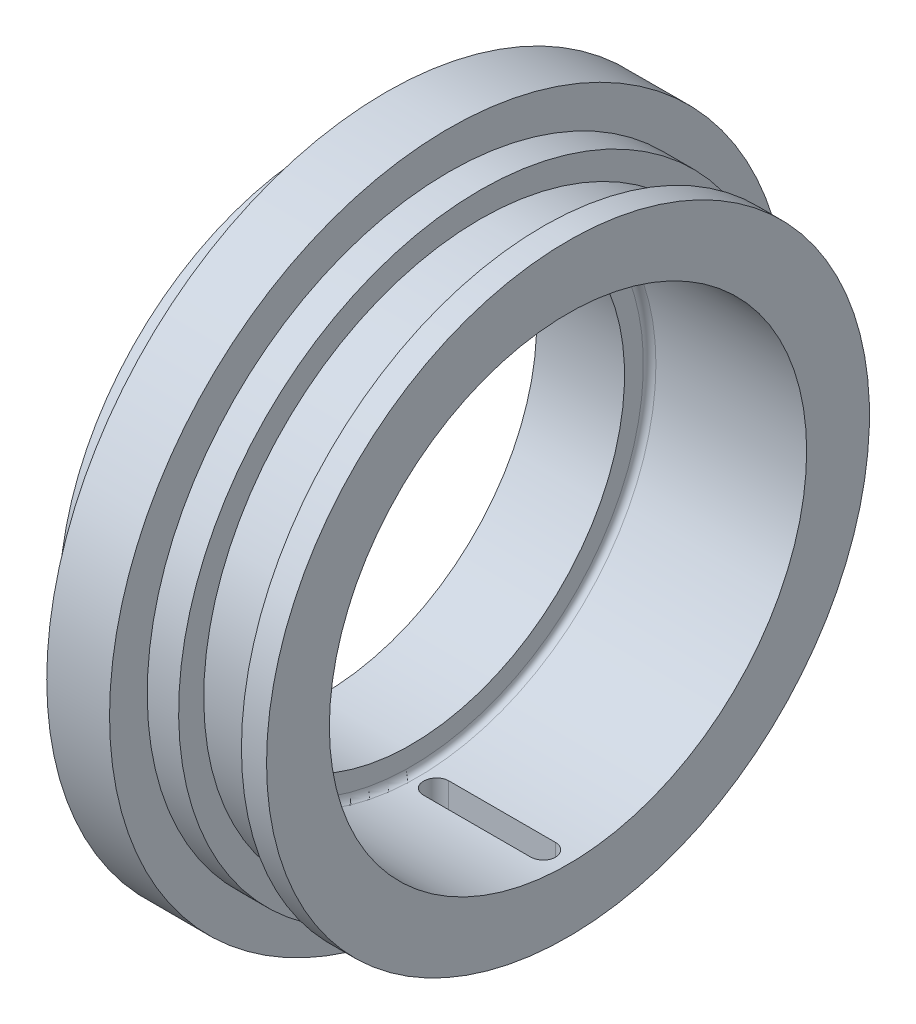
ISO-10303-21;
HEADER;
FILE_DESCRIPTION(('STEP AP214'),'2;1');
FILE_NAME('part.step','',(''),(''),'','','');
FILE_SCHEMA(('AUTOMOTIVE_DESIGN { 1 0 10303 214 1 1 1 1 }'));
ENDSEC;
DATA;
#1=APPLICATION_CONTEXT('core data for automotive mechanical design processes');
#2=APPLICATION_PROTOCOL_DEFINITION('international standard','automotive_design',2000,#1);
#3=PRODUCT_CONTEXT('',#1,'mechanical');
#4=PRODUCT('Part','Part','',(#3));
#5=PRODUCT_RELATED_PRODUCT_CATEGORY('part','',(#4));
#6=PRODUCT_DEFINITION_FORMATION('','',#4);
#7=PRODUCT_DEFINITION_CONTEXT('part definition',#1,'design');
#8=PRODUCT_DEFINITION('design','',#6,#7);
#9=PRODUCT_DEFINITION_SHAPE('','',#8);
#10=(LENGTH_UNIT() NAMED_UNIT(*) SI_UNIT(.MILLI.,.METRE.));
#11=(NAMED_UNIT(*) PLANE_ANGLE_UNIT() SI_UNIT($,.RADIAN.));
#12=(NAMED_UNIT(*) SI_UNIT($,.STERADIAN.) SOLID_ANGLE_UNIT());
#13=UNCERTAINTY_MEASURE_WITH_UNIT(LENGTH_MEASURE(1.E-05),#10,'distance_accuracy_value','');
#14=(GEOMETRIC_REPRESENTATION_CONTEXT(3) GLOBAL_UNCERTAINTY_ASSIGNED_CONTEXT((#13)) GLOBAL_UNIT_ASSIGNED_CONTEXT((#10,
#11,#12)) REPRESENTATION_CONTEXT('',''));
#15=CARTESIAN_POINT('',(0.,0.,0.));
#16=DIRECTION('',(0.,0.,1.));
#17=DIRECTION('',(1.,0.,0.));
#18=AXIS2_PLACEMENT_3D('',#15,#16,#17);
#19=CARTESIAN_POINT('',(-351.05,19.,0.));
#20=DIRECTION('',(-1.,0.,0.));
#21=DIRECTION('',(0.,0.,1.));
#22=AXIS2_PLACEMENT_3D('',#19,#20,#21);
#23=PLANE('',#22);
#24=CARTESIAN_POINT('',(-351.05,0.,0.));
#25=DIRECTION('',(-1.,0.,0.));
#26=DIRECTION('',(0.,0.,1.));
#27=AXIS2_PLACEMENT_3D('',#24,#25,#26);
#28=CIRCLE('',#27,23.9999999999999);
#29=CARTESIAN_POINT('',(-351.05,0.,23.9999999999999));
#30=VERTEX_POINT('',#29);
#31=EDGE_CURVE('E226',#30,#30,#28,.T.);
#32=ORIENTED_EDGE('',*,*,#31,.F.);
#33=EDGE_LOOP('',(#32));
#34=FACE_BOUND('',#33,.T.);
#35=CARTESIAN_POINT('',(-351.05,0.,0.));
#36=DIRECTION('',(-1.,0.,0.));
#37=DIRECTION('',(0.,0.,1.));
#38=AXIS2_PLACEMENT_3D('',#35,#36,#37);
#39=CIRCLE('',#38,19.);
#40=CARTESIAN_POINT('',(-351.05,0.,19.));
#41=VERTEX_POINT('',#40);
#42=EDGE_CURVE('E182',#41,#41,#39,.T.);
#43=ORIENTED_EDGE('',*,*,#42,.T.);
#44=EDGE_LOOP('',(#43));
#45=FACE_BOUND('',#44,.T.);
#46=ADVANCED_FACE('F40',(#34,#45),#23,.F.);
#47=CARTESIAN_POINT('',(-379.936676628727,0.,0.));
#48=DIRECTION('',(-1.,0.,0.));
#49=DIRECTION('',(0.,0.,1.));
#50=AXIS2_PLACEMENT_3D('',#47,#48,#49);
#51=CYLINDRICAL_SURFACE('',#50,23.9999999999999);
#52=CARTESIAN_POINT('',(-353.05,0.,0.));
#53=DIRECTION('',(-1.,0.,0.));
#54=DIRECTION('',(0.,0.,1.));
#55=AXIS2_PLACEMENT_3D('',#52,#53,#54);
#56=CIRCLE('',#55,23.9999999999999);
#57=CARTESIAN_POINT('',(-353.05,-23.9791576165635,1.));
#58=VERTEX_POINT('',#57);
#59=CARTESIAN_POINT('',(-353.05,-23.9791576165635,-1.));
#60=VERTEX_POINT('',#59);
#61=EDGE_CURVE('E223',#58,#60,#56,.T.);
#62=ORIENTED_EDGE('',*,*,#61,.F.);
#63=CARTESIAN_POINT('',(-353.05,-23.9791576165635,-1.));
#64=CARTESIAN_POINT('',(-353.021878957385,-23.9791573385159,-0.999999827751996));
#65=CARTESIAN_POINT('',(-352.993771399304,-23.9792071471564,-0.99881306616118));
#66=CARTESIAN_POINT('',(-352.937757642638,-23.9794039927136,-0.994078686094258));
#67=CARTESIAN_POINT('',(-352.909851433839,-23.9795510246631,-0.990531188228068));
#68=CARTESIAN_POINT('',(-352.826782544367,-23.9801329123692,-0.976381299636252));
#69=CARTESIAN_POINT('',(-352.772176693938,-23.980708578784,-0.96227142081713));
#70=CARTESIAN_POINT('',(-352.666113877668,-23.9821714364867,-0.925091988008807));
#71=CARTESIAN_POINT('',(-352.614658336882,-23.9830587675522,-0.902018413424585));
#72=CARTESIAN_POINT('',(-352.516352897202,-23.9850445854284,-0.847570330342763));
#73=CARTESIAN_POINT('',(-352.46950215651,-23.9861430335361,-0.816197342938941));
#74=CARTESIAN_POINT('',(-352.381705963261,-23.9884281594866,-0.746018660575475));
#75=CARTESIAN_POINT('',(-352.340763848984,-23.9896148866363,-0.707208792493843));
#76=CARTESIAN_POINT('',(-352.26596747742,-23.9919425217121,-0.623260548927584));
#77=CARTESIAN_POINT('',(-352.232114300049,-23.9930834226357,-0.578121210967041));
#78=CARTESIAN_POINT('',(-352.172455072029,-23.9951910307319,-0.482781699887445));
#79=CARTESIAN_POINT('',(-352.146651602661,-23.9961576819864,-0.432579910217997));
#80=CARTESIAN_POINT('',(-352.103842156875,-23.9978072858589,-0.328555206896849));
#81=CARTESIAN_POINT('',(-352.086835586406,-23.9984902576331,-0.274732538039683));
#82=CARTESIAN_POINT('',(-352.062109654267,-23.9994952696334,-0.16502344784435));
#83=CARTESIAN_POINT('',(-352.054385025953,-23.9998175145316,-0.109138215393339));
#84=CARTESIAN_POINT('',(-352.048425961082,-24.0000654431746,0.00313799608098518));
#85=CARTESIAN_POINT('',(-352.050191702193,-23.9999911194953,0.0595289845527943));
#86=CARTESIAN_POINT('',(-352.063159191693,-23.9994544467782,0.17117717141178));
#87=CARTESIAN_POINT('',(-352.074354985778,-23.9989923425928,0.226435062709367));
#88=CARTESIAN_POINT('',(-352.105855518668,-23.9977324592887,0.334286162822794));
#89=CARTESIAN_POINT('',(-352.12616024729,-23.9969346805453,0.386879374617531));
#90=CARTESIAN_POINT('',(-352.175309544836,-23.995092896028,0.487928656756748));
#91=CARTESIAN_POINT('',(-352.204157014358,-23.9940488066466,0.536383314688192));
#92=CARTESIAN_POINT('',(-352.269569406668,-23.9918320934257,0.627761971064696));
#93=CARTESIAN_POINT('',(-352.30613399507,-23.9906594751566,0.670686209015598));
#94=CARTESIAN_POINT('',(-352.385970360387,-23.9883168597931,0.749817172069834));
#95=CARTESIAN_POINT('',(-352.429246325357,-23.9871468648014,0.786019671443447));
#96=CARTESIAN_POINT('',(-352.521281255319,-23.984941758122,0.850657803488658));
#97=CARTESIAN_POINT('',(-352.570041944584,-23.983906689074,0.879090983975148));
#98=CARTESIAN_POINT('',(-352.671670888822,-23.982088107858,0.927381585411384));
#99=CARTESIAN_POINT('',(-352.724541696933,-23.9813047536272,0.947233624856723));
#100=CARTESIAN_POINT('',(-352.832828915137,-23.9800801998383,0.97774777026732));
#101=CARTESIAN_POINT('',(-352.888241307446,-23.9796384787119,0.988423887820018));
#102=CARTESIAN_POINT('',(-352.961687747243,-23.9793136836998,0.996251123804624));
#103=CARTESIAN_POINT('',(-352.979336403255,-23.9792551894172,0.99765768814785));
#104=CARTESIAN_POINT('',(-353.014654311973,-23.9791772074594,0.999530844671079));
#105=CARTESIAN_POINT('',(-353.032323482083,-23.9791576553063,0.999998990632797));
#106=CARTESIAN_POINT('',(-353.05,-23.9791576165635,1.));
#107=B_SPLINE_CURVE_WITH_KNOTS('',3,(#63,#64,#65,#66,#67,#68,#69,#70,#71,#72,#73,#74,#75,#76,
#77,#78,#79,#80,#81,#82,#83,#84,#85,#86,#87,#88,#89,#90,#91,#92,#93,#94,#95,#96,#97,#98,#99,
#100,#101,#102,#103,#104,#105,#106),.UNSPECIFIED.,.F.,.F.,(4,2,2,2,2,2,2,2,2,2,2,2,2,2,2,2,2,2,
2,2,2,4),(0.,0.0843112718973622,0.168618236666047,0.336956996072197,0.505371349843703,
0.673754858450239,0.84223313173336,1.01073705210699,1.17929495084417,1.34784146542164,
1.5162923002099,1.68474628856682,1.85309399172124,2.0214415066722,2.18984624788381,
2.3582436935399,2.5267466491502,2.6953027271015,2.86396435906508,3.0323679856424,
3.08546462609338,3.13847327917958),.UNSPECIFIED.);
#108=EDGE_CURVE('E175',#60,#58,#107,.T.);
#109=ORIENTED_EDGE('',*,*,#108,.F.);
#110=EDGE_LOOP('',(#62,#109));
#111=FACE_BOUND('',#110,.T.);
#112=ORIENTED_EDGE('',*,*,#31,.T.);
#113=EDGE_LOOP('',(#112));
#114=FACE_BOUND('',#113,.T.);
#115=ADVANCED_FACE('F240',(#111,#114),#51,.T.);
#116=CARTESIAN_POINT('',(-353.05,23.9999999999999,0.));
#117=DIRECTION('',(1.,0.,0.));
#118=DIRECTION('',(0.,0.,-1.));
#119=AXIS2_PLACEMENT_3D('',#116,#117,#118);
#120=PLANE('',#119);
#121=ORIENTED_EDGE('',*,*,#61,.T.);
#122=DIRECTION('',(0.,1.,0.));
#123=VECTOR('',#122,1.);
#124=CARTESIAN_POINT('',(-353.05,-27.0009999999999,-1.));
#125=LINE('',#124,#123);
#126=CARTESIAN_POINT('',(-353.05,-21.9772609758359,-1.));
#127=VERTEX_POINT('',#126);
#128=EDGE_CURVE('E118',#60,#127,#125,.T.);
#129=ORIENTED_EDGE('',*,*,#128,.T.);
#130=CARTESIAN_POINT('',(-353.05,0.,0.));
#131=DIRECTION('',(-1.,0.,0.));
#132=DIRECTION('',(0.,0.,1.));
#133=AXIS2_PLACEMENT_3D('',#130,#131,#132);
#134=CIRCLE('',#133,21.9999999999999);
#135=CARTESIAN_POINT('',(-353.05,-21.9772609758359,1.));
#136=VERTEX_POINT('',#135);
#137=EDGE_CURVE('E220',#136,#127,#134,.T.);
#138=ORIENTED_EDGE('',*,*,#137,.F.);
#139=DIRECTION('',(0.,1.,0.));
#140=VECTOR('',#139,1.);
#141=CARTESIAN_POINT('',(-353.05,-27.0009999999999,1.));
#142=LINE('',#141,#140);
#143=EDGE_CURVE('E342',#58,#136,#142,.T.);
#144=ORIENTED_EDGE('',*,*,#143,.F.);
#145=EDGE_LOOP('',(#121,#129,#138,#144));
#146=FACE_BOUND('',#145,.T.);
#147=ADVANCED_FACE('F245',(#146),#120,.F.);
#148=CARTESIAN_POINT('',(-379.936676628727,0.,0.));
#149=DIRECTION('',(-1.,0.,0.));
#150=DIRECTION('',(0.,0.,1.));
#151=AXIS2_PLACEMENT_3D('',#148,#149,#150);
#152=CYLINDRICAL_SURFACE('',#151,21.9999999999999);
#153=CARTESIAN_POINT('',(-358.05,0.,0.));
#154=DIRECTION('',(-1.,0.,0.));
#155=DIRECTION('',(0.,0.,1.));
#156=AXIS2_PLACEMENT_3D('',#153,#154,#155);
#157=CIRCLE('',#156,21.9999999999999);
#158=CARTESIAN_POINT('',(-358.05,-21.9772609758359,1.));
#159=VERTEX_POINT('',#158);
#160=CARTESIAN_POINT('',(-358.05,-21.9772609758359,-0.999999999999999));
#161=VERTEX_POINT('',#160);
#162=EDGE_CURVE('E217',#159,#161,#157,.T.);
#163=ORIENTED_EDGE('',*,*,#162,.F.);
#164=DIRECTION('',(-1.,0.,0.));
#165=VECTOR('',#164,1.);
#166=CARTESIAN_POINT('',(-379.936676628727,-21.9772609758359,1.));
#167=LINE('',#166,#165);
#168=EDGE_CURVE('E339',#136,#159,#167,.T.);
#169=ORIENTED_EDGE('',*,*,#168,.F.);
#170=ORIENTED_EDGE('',*,*,#137,.T.);
#171=DIRECTION('',(-1.,0.,0.));
#172=VECTOR('',#171,1.);
#173=CARTESIAN_POINT('',(-379.936676628727,-21.9772609758359,-0.999999999999996));
#174=LINE('',#173,#172);
#175=EDGE_CURVE('E183',#161,#127,#174,.F.);
#176=ORIENTED_EDGE('',*,*,#175,.F.);
#177=EDGE_LOOP('',(#163,#169,#170,#176));
#178=FACE_BOUND('',#177,.T.);
#179=ADVANCED_FACE('F253',(#178),#152,.T.);
#180=CARTESIAN_POINT('',(-358.05,21.9999999999999,0.));
#181=DIRECTION('',(-1.,0.,0.));
#182=DIRECTION('',(0.,0.,1.));
#183=AXIS2_PLACEMENT_3D('',#180,#181,#182);
#184=PLANE('',#183);
#185=CARTESIAN_POINT('',(-358.05,0.,0.));
#186=DIRECTION('',(-1.,0.,0.));
#187=DIRECTION('',(0.,0.,1.));
#188=AXIS2_PLACEMENT_3D('',#185,#186,#187);
#189=CIRCLE('',#188,23.9999999999999);
#190=CARTESIAN_POINT('',(-358.05,-23.9791576165635,1.));
#191=VERTEX_POINT('',#190);
#192=CARTESIAN_POINT('',(-358.05,-23.9791576165635,-0.999999999999996));
#193=VERTEX_POINT('',#192);
#194=EDGE_CURVE('E214',#191,#193,#189,.T.);
#195=ORIENTED_EDGE('',*,*,#194,.F.);
#196=DIRECTION('',(0.,-1.,0.));
#197=VECTOR('',#196,1.);
#198=CARTESIAN_POINT('',(-358.05,-27.0009999999999,1.));
#199=LINE('',#198,#197);
#200=EDGE_CURVE('E343',#159,#191,#199,.T.);
#201=ORIENTED_EDGE('',*,*,#200,.F.);
#202=ORIENTED_EDGE('',*,*,#162,.T.);
#203=DIRECTION('',(0.,1.,0.));
#204=VECTOR('',#203,1.);
#205=CARTESIAN_POINT('',(-358.05,-27.0009999999999,-0.999999999999999));
#206=LINE('',#205,#204);
#207=EDGE_CURVE('E329',#193,#161,#206,.T.);
#208=ORIENTED_EDGE('',*,*,#207,.F.);
#209=EDGE_LOOP('',(#195,#201,#202,#208));
#210=FACE_BOUND('',#209,.T.);
#211=ADVANCED_FACE('F257',(#210),#184,.F.);
#212=CARTESIAN_POINT('',(-379.936676628727,0.,0.));
#213=DIRECTION('',(-1.,0.,0.));
#214=DIRECTION('',(0.,0.,1.));
#215=AXIS2_PLACEMENT_3D('',#212,#213,#214);
#216=CYLINDRICAL_SURFACE('',#215,23.9999999999999);
#217=CARTESIAN_POINT('',(-360.55,0.,0.));
#218=DIRECTION('',(-1.,0.,0.));
#219=DIRECTION('',(0.,0.,1.));
#220=AXIS2_PLACEMENT_3D('',#217,#218,#219);
#221=CIRCLE('',#220,23.9999999999999);
#222=CARTESIAN_POINT('',(-360.55,-23.9791576165635,1.));
#223=VERTEX_POINT('',#222);
#224=CARTESIAN_POINT('',(-360.55,-23.9791576165635,-0.999999999999999));
#225=VERTEX_POINT('',#224);
#226=EDGE_CURVE('E211',#223,#225,#221,.T.);
#227=ORIENTED_EDGE('',*,*,#226,.F.);
#228=DIRECTION('',(-1.,0.,0.));
#229=VECTOR('',#228,1.);
#230=CARTESIAN_POINT('',(-379.936676628727,-23.9791576165635,1.));
#231=LINE('',#230,#229);
#232=EDGE_CURVE('E347',#191,#223,#231,.T.);
#233=ORIENTED_EDGE('',*,*,#232,.F.);
#234=ORIENTED_EDGE('',*,*,#194,.T.);
#235=DIRECTION('',(-1.,0.,0.));
#236=VECTOR('',#235,1.);
#237=CARTESIAN_POINT('',(-379.936676628727,-23.9791576165635,-0.999999999999996));
#238=LINE('',#237,#236);
#239=EDGE_CURVE('E324',#225,#193,#238,.F.);
#240=ORIENTED_EDGE('',*,*,#239,.F.);
#241=EDGE_LOOP('',(#227,#233,#234,#240));
#242=FACE_BOUND('',#241,.T.);
#243=ADVANCED_FACE('F261',(#242),#216,.T.);
#244=CARTESIAN_POINT('',(-360.55,23.9999999999999,0.));
#245=DIRECTION('',(-1.,0.,0.));
#246=DIRECTION('',(0.,0.,1.));
#247=AXIS2_PLACEMENT_3D('',#244,#245,#246);
#248=PLANE('',#247);
#249=CARTESIAN_POINT('',(-360.55,0.,0.));
#250=DIRECTION('',(-1.,0.,0.));
#251=DIRECTION('',(0.,0.,1.));
#252=AXIS2_PLACEMENT_3D('',#249,#250,#251);
#253=CIRCLE('',#252,26.9999999999999);
#254=CARTESIAN_POINT('',(-360.55,-26.981475126464,1.));
#255=VERTEX_POINT('',#254);
#256=CARTESIAN_POINT('',(-360.55,-26.981475126464,-0.999999999999996));
#257=VERTEX_POINT('',#256);
#258=EDGE_CURVE('E208',#255,#257,#253,.T.);
#259=ORIENTED_EDGE('',*,*,#258,.F.);
#260=DIRECTION('',(0.,-1.,0.));
#261=VECTOR('',#260,1.);
#262=CARTESIAN_POINT('',(-360.55,-27.0009999999999,1.));
#263=LINE('',#262,#261);
#264=EDGE_CURVE('E352',#223,#255,#263,.T.);
#265=ORIENTED_EDGE('',*,*,#264,.F.);
#266=ORIENTED_EDGE('',*,*,#226,.T.);
#267=DIRECTION('',(0.,1.,0.));
#268=VECTOR('',#267,1.);
#269=CARTESIAN_POINT('',(-360.55,-27.0009999999999,-0.999999999999999));
#270=LINE('',#269,#268);
#271=EDGE_CURVE('E321',#257,#225,#270,.T.);
#272=ORIENTED_EDGE('',*,*,#271,.F.);
#273=EDGE_LOOP('',(#259,#265,#266,#272));
#274=FACE_BOUND('',#273,.T.);
#275=ADVANCED_FACE('F265',(#274),#248,.F.);
#276=CARTESIAN_POINT('',(-379.936676628727,0.,0.));
#277=DIRECTION('',(-1.,0.,0.));
#278=DIRECTION('',(0.,0.,1.));
#279=AXIS2_PLACEMENT_3D('',#276,#277,#278);
#280=CYLINDRICAL_SURFACE('',#279,26.9999999999999);
#281=CARTESIAN_POINT('',(-365.55,0.,0.));
#282=DIRECTION('',(-1.,0.,0.));
#283=DIRECTION('',(0.,0.,1.));
#284=AXIS2_PLACEMENT_3D('',#281,#282,#283);
#285=CIRCLE('',#284,26.9999999999999);
#286=CARTESIAN_POINT('',(-365.55,0.,26.9999999999999));
#287=VERTEX_POINT('',#286);
#288=EDGE_CURVE('E205',#287,#287,#285,.T.);
#289=ORIENTED_EDGE('',*,*,#288,.F.);
#290=EDGE_LOOP('',(#289));
#291=FACE_BOUND('',#290,.T.);
#292=CARTESIAN_POINT('',(-361.55,-26.981475126464,1.));
#293=CARTESIAN_POINT('',(-361.578123764318,-26.9814748794738,0.999999824698651));
#294=CARTESIAN_POINT('',(-361.606234045268,-26.9815191541466,0.998812836472681));
#295=CARTESIAN_POINT('',(-361.662253278417,-26.9816941302732,0.994077532231824));
#296=CARTESIAN_POINT('',(-361.690162240694,-26.9818248273699,0.990529335260153));
#297=CARTESIAN_POINT('',(-361.773239825204,-26.9823420739736,0.976376540344223));
#298=CARTESIAN_POINT('',(-361.82785163761,-26.9828537954201,0.962263645915876));
#299=CARTESIAN_POINT('',(-361.933926303315,-26.9841541819976,0.925075741035457));
#300=CARTESIAN_POINT('',(-361.985387721369,-26.9849429722683,0.901996680466889));
#301=CARTESIAN_POINT('',(-362.083703709108,-26.9867082740513,0.847535199831461));
#302=CARTESIAN_POINT('',(-362.130559133543,-26.9876847506344,0.816154324363545));
#303=CARTESIAN_POINT('',(-362.218357597366,-26.9897160111313,0.745961868658856));
#304=CARTESIAN_POINT('',(-362.259297970991,-26.9907708300297,0.707146956303965));
#305=CARTESIAN_POINT('',(-362.334089611029,-26.9928397056618,0.62318891477266));
#306=CARTESIAN_POINT('',(-362.367939797247,-26.9938537561655,0.578044823086961));
#307=CARTESIAN_POINT('',(-362.427589399492,-26.9957268983942,0.482700548441983));
#308=CARTESIAN_POINT('',(-362.453386851292,-26.9965859522909,0.432499135842309));
#309=CARTESIAN_POINT('',(-362.496184719096,-26.9980518832871,0.32847721466373));
#310=CARTESIAN_POINT('',(-362.513185722553,-26.998658777226,0.274656948034259));
#311=CARTESIAN_POINT('',(-362.537903169209,-26.9995518215056,0.164947575442182));
#312=CARTESIAN_POINT('',(-362.545623734706,-26.9998381142508,0.10905939940878));
#313=CARTESIAN_POINT('',(-362.551573902953,-27.0000581671667,-0.00322180622740716));
#314=CARTESIAN_POINT('',(-362.549803319502,-26.9999919204211,-0.0596148457130976));
#315=CARTESIAN_POINT('',(-362.536824571211,-26.9995144696862,-0.171273925363395));
#316=CARTESIAN_POINT('',(-362.525621131535,-26.9991034384089,-0.226540515602228));
#317=CARTESIAN_POINT('',(-362.494102042616,-26.9979829372992,-0.334407730340085));
#318=CARTESIAN_POINT('',(-362.47378640745,-26.9972734679279,-0.38700835895778));
#319=CARTESIAN_POINT('',(-362.424613739194,-26.9956357247524,-0.488067016544142));
#320=CARTESIAN_POINT('',(-362.395754363855,-26.9947073909611,-0.536523904813876));
#321=CARTESIAN_POINT('',(-362.330316543153,-26.9927365807336,-0.62790445511051));
#322=CARTESIAN_POINT('',(-362.293738441844,-26.991694109386,-0.670828363627695));
#323=CARTESIAN_POINT('',(-362.213880770237,-26.9896118385913,-0.749948942898146));
#324=CARTESIAN_POINT('',(-362.170598079186,-26.9885720406189,-0.786142463539205));
#325=CARTESIAN_POINT('',(-362.078551831161,-26.9866124937511,-0.850761468671621));
#326=CARTESIAN_POINT('',(-362.029786547609,-26.9856927828717,-0.87918449635289));
#327=CARTESIAN_POINT('',(-361.928151348925,-26.9840770650097,-0.927453976043975));
#328=CARTESIAN_POINT('',(-361.875278900306,-26.9833811974862,-0.947295083974995));
#329=CARTESIAN_POINT('',(-361.766991181205,-26.982293604586,-0.977787559162749));
#330=CARTESIAN_POINT('',(-361.711579925829,-26.9819014154089,-0.988452943046858));
#331=CARTESIAN_POINT('',(-361.63816484091,-26.9816133646762,-0.996263651329324));
#332=CARTESIAN_POINT('',(-361.620545540678,-26.9815615524811,-0.9976655168847));
#333=CARTESIAN_POINT('',(-361.585286547894,-26.9814924792199,-0.999532413490946));
#334=CARTESIAN_POINT('',(-361.567646937453,-26.981475161069,-0.999998992371764));
#335=CARTESIAN_POINT('',(-361.55,-26.981475126464,-1.));
#336=B_SPLINE_CURVE_WITH_KNOTS('',3,(#292,#293,#294,#295,#296,#297,#298,#299,#300,#301,#302,
#303,#304,#305,#306,#307,#308,#309,#310,#311,#312,#313,#314,#315,#316,#317,#318,#319,#320,#321,
#322,#323,#324,#325,#326,#327,#328,#329,#330,#331,#332,#333,#334,#335),.UNSPECIFIED.,.F.,.F.,(4,
2,2,2,2,2,2,2,2,2,2,2,2,2,2,2,2,2,2,2,2,4),(0.,0.0843194399560269,0.168634629166713,
0.336991063676523,0.505423635239913,0.673824890997088,0.84230180573804,1.01080436943569,
1.17934800229744,1.34788037784782,1.51633786493823,1.68479865689369,1.85317511257985,
2.02155130813153,2.18997370647479,2.35838859912579,2.52688211990374,2.69542885211866,
2.86408039011078,3.03247384007261,3.0854816231228,3.1384016095674),.UNSPECIFIED.);
#337=CARTESIAN_POINT('',(-361.55,-26.981475126464,1.));
#338=VERTEX_POINT('',#337);
#339=CARTESIAN_POINT('',(-361.55,-26.981475126464,-0.999999999999996));
#340=VERTEX_POINT('',#339);
#341=EDGE_CURVE('E55',#338,#340,#336,.T.);
#342=ORIENTED_EDGE('',*,*,#341,.F.);
#343=DIRECTION('',(-1.,0.,0.));
#344=VECTOR('',#343,1.);
#345=CARTESIAN_POINT('',(-379.936676628727,-26.981475126464,1.));
#346=LINE('',#345,#344);
#347=EDGE_CURVE('E132',#255,#338,#346,.T.);
#348=ORIENTED_EDGE('',*,*,#347,.F.);
#349=ORIENTED_EDGE('',*,*,#258,.T.);
#350=DIRECTION('',(-1.,0.,0.));
#351=VECTOR('',#350,1.);
#352=CARTESIAN_POINT('',(-379.936676628727,-26.981475126464,-0.999999999999996));
#353=LINE('',#352,#351);
#354=EDGE_CURVE('E319',#340,#257,#353,.F.);
#355=ORIENTED_EDGE('',*,*,#354,.F.);
#356=EDGE_LOOP('',(#342,#348,#349,#355));
#357=FACE_BOUND('',#356,.T.);
#358=ADVANCED_FACE('F269',(#291,#357),#280,.T.);
#359=CARTESIAN_POINT('',(-365.55,26.9999999999999,0.));
#360=DIRECTION('',(1.,0.,0.));
#361=DIRECTION('',(0.,0.,-1.));
#362=AXIS2_PLACEMENT_3D('',#359,#360,#361);
#363=PLANE('',#362);
#364=CARTESIAN_POINT('',(-365.55,0.,0.));
#365=DIRECTION('',(-1.,0.,0.));
#366=DIRECTION('',(0.,0.,1.));
#367=AXIS2_PLACEMENT_3D('',#364,#365,#366);
#368=CIRCLE('',#367,20.);
#369=CARTESIAN_POINT('',(-365.55,0.,20.));
#370=VERTEX_POINT('',#369);
#371=EDGE_CURVE('E202',#370,#370,#368,.T.);
#372=ORIENTED_EDGE('',*,*,#371,.F.);
#373=EDGE_LOOP('',(#372));
#374=FACE_BOUND('',#373,.T.);
#375=ORIENTED_EDGE('',*,*,#288,.T.);
#376=EDGE_LOOP('',(#375));
#377=FACE_BOUND('',#376,.T.);
#378=ADVANCED_FACE('F273',(#374,#377),#363,.F.);
#379=CARTESIAN_POINT('',(-379.936676628727,0.,0.));
#380=DIRECTION('',(-1.,0.,0.));
#381=DIRECTION('',(0.,0.,1.));
#382=AXIS2_PLACEMENT_3D('',#379,#380,#381);
#383=CYLINDRICAL_SURFACE('',#382,20.);
#384=CARTESIAN_POINT('',(-367.05,0.,0.));
#385=DIRECTION('',(-1.,0.,0.));
#386=DIRECTION('',(0.,0.,1.));
#387=AXIS2_PLACEMENT_3D('',#384,#385,#386);
#388=CIRCLE('',#387,20.);
#389=CARTESIAN_POINT('',(-367.05,0.,20.));
#390=VERTEX_POINT('',#389);
#391=EDGE_CURVE('E199',#390,#390,#388,.T.);
#392=ORIENTED_EDGE('',*,*,#391,.F.);
#393=EDGE_LOOP('',(#392));
#394=FACE_BOUND('',#393,.T.);
#395=ORIENTED_EDGE('',*,*,#371,.T.);
#396=EDGE_LOOP('',(#395));
#397=FACE_BOUND('',#396,.T.);
#398=ADVANCED_FACE('F277',(#394,#397),#383,.T.);
#399=CARTESIAN_POINT('',(-367.05,0.,0.));
#400=DIRECTION('',(-1.,0.,0.));
#401=DIRECTION('',(0.,0.,1.));
#402=AXIS2_PLACEMENT_3D('',#399,#400,#401);
#403=CONICAL_SURFACE('',#402,20.,1.10714871779409);
#404=CARTESIAN_POINT('',(-367.55,0.,0.));
#405=DIRECTION('',(-1.,0.,0.));
#406=DIRECTION('',(0.,0.,1.));
#407=AXIS2_PLACEMENT_3D('',#404,#405,#406);
#408=CIRCLE('',#407,21.);
#409=CARTESIAN_POINT('',(-367.55,0.,21.));
#410=VERTEX_POINT('',#409);
#411=EDGE_CURVE('E196',#410,#410,#408,.T.);
#412=ORIENTED_EDGE('',*,*,#411,.F.);
#413=EDGE_LOOP('',(#412));
#414=FACE_BOUND('',#413,.T.);
#415=ORIENTED_EDGE('',*,*,#391,.T.);
#416=EDGE_LOOP('',(#415));
#417=FACE_BOUND('',#416,.T.);
#418=ADVANCED_FACE('F281',(#414,#417),#403,.T.);
#419=CARTESIAN_POINT('',(-379.936676628727,0.,0.));
#420=DIRECTION('',(-1.,0.,0.));
#421=DIRECTION('',(0.,0.,1.));
#422=AXIS2_PLACEMENT_3D('',#419,#420,#421);
#423=CYLINDRICAL_SURFACE('',#422,21.);
#424=CARTESIAN_POINT('',(-370.55,0.,0.));
#425=DIRECTION('',(-1.,0.,0.));
#426=DIRECTION('',(0.,0.,1.));
#427=AXIS2_PLACEMENT_3D('',#424,#425,#426);
#428=CIRCLE('',#427,21.);
#429=CARTESIAN_POINT('',(-370.55,0.,21.));
#430=VERTEX_POINT('',#429);
#431=EDGE_CURVE('E193',#430,#430,#428,.T.);
#432=ORIENTED_EDGE('',*,*,#431,.F.);
#433=EDGE_LOOP('',(#432));
#434=FACE_BOUND('',#433,.T.);
#435=ORIENTED_EDGE('',*,*,#411,.T.);
#436=EDGE_LOOP('',(#435));
#437=FACE_BOUND('',#436,.T.);
#438=ADVANCED_FACE('F285',(#434,#437),#423,.T.);
#439=CARTESIAN_POINT('',(-370.55,17.,0.));
#440=DIRECTION('',(1.,0.,0.));
#441=DIRECTION('',(0.,0.,-1.));
#442=AXIS2_PLACEMENT_3D('',#439,#440,#441);
#443=PLANE('',#442);
#444=CARTESIAN_POINT('',(-370.55,0.,0.));
#445=DIRECTION('',(-1.,0.,0.));
#446=DIRECTION('',(0.,0.,1.));
#447=AXIS2_PLACEMENT_3D('',#444,#445,#446);
#448=CIRCLE('',#447,17.);
#449=CARTESIAN_POINT('',(-370.55,0.,17.));
#450=VERTEX_POINT('',#449);
#451=EDGE_CURVE('E190',#450,#450,#448,.T.);
#452=ORIENTED_EDGE('',*,*,#451,.F.);
#453=EDGE_LOOP('',(#452));
#454=FACE_BOUND('',#453,.T.);
#455=ORIENTED_EDGE('',*,*,#431,.T.);
#456=EDGE_LOOP('',(#455));
#457=FACE_BOUND('',#456,.T.);
#458=ADVANCED_FACE('F289',(#454,#457),#443,.F.);
#459=CARTESIAN_POINT('',(-379.936676628727,0.,0.));
#460=DIRECTION('',(-1.,0.,0.));
#461=DIRECTION('',(0.,0.,1.));
#462=AXIS2_PLACEMENT_3D('',#459,#460,#461);
#463=CYLINDRICAL_SURFACE('',#462,17.);
#464=CARTESIAN_POINT('',(-363.55,0.,0.));
#465=DIRECTION('',(-1.,0.,0.));
#466=DIRECTION('',(0.,0.,1.));
#467=AXIS2_PLACEMENT_3D('',#464,#465,#466);
#468=CIRCLE('',#467,17.);
#469=CARTESIAN_POINT('',(-363.55,0.,17.));
#470=VERTEX_POINT('',#469);
#471=EDGE_CURVE('E187',#470,#470,#468,.T.);
#472=ORIENTED_EDGE('',*,*,#471,.F.);
#473=EDGE_LOOP('',(#472));
#474=FACE_BOUND('',#473,.T.);
#475=ORIENTED_EDGE('',*,*,#451,.T.);
#476=EDGE_LOOP('',(#475));
#477=FACE_BOUND('',#476,.T.);
#478=ADVANCED_FACE('F293',(#474,#477),#463,.F.);
#479=CARTESIAN_POINT('',(-363.55,19.,0.));
#480=DIRECTION('',(-1.,0.,0.));
#481=DIRECTION('',(0.,0.,1.));
#482=AXIS2_PLACEMENT_3D('',#479,#480,#481);
#483=PLANE('',#482);
#484=CARTESIAN_POINT('',(-363.55,0.,0.));
#485=DIRECTION('',(-1.,0.,0.));
#486=DIRECTION('',(0.,0.,1.));
#487=AXIS2_PLACEMENT_3D('',#484,#485,#486);
#488=CIRCLE('',#487,18.5);
#489=CARTESIAN_POINT('',(-363.55,0.,18.5));
#490=VERTEX_POINT('',#489);
#491=EDGE_CURVE('E11',#490,#490,#488,.F.);
#492=ORIENTED_EDGE('',*,*,#491,.T.);
#493=EDGE_LOOP('',(#492));
#494=FACE_BOUND('',#493,.T.);
#495=ORIENTED_EDGE('',*,*,#471,.T.);
#496=EDGE_LOOP('',(#495));
#497=FACE_BOUND('',#496,.T.);
#498=ADVANCED_FACE('F237',(#494,#497),#483,.F.);
#499=CARTESIAN_POINT('',(-379.936676628727,0.,0.));
#500=DIRECTION('',(-1.,0.,0.));
#501=DIRECTION('',(0.,0.,1.));
#502=AXIS2_PLACEMENT_3D('',#499,#500,#501);
#503=CYLINDRICAL_SURFACE('',#502,19.);
#504=DIRECTION('',(-1.,0.,0.));
#505=VECTOR('',#504,1.);
#506=CARTESIAN_POINT('',(-379.936676628727,-18.9736659610103,-0.999999999999995));
#507=LINE('',#506,#505);
#508=CARTESIAN_POINT('',(-361.55,-18.9736659610103,-1.));
#509=VERTEX_POINT('',#508);
#510=CARTESIAN_POINT('',(-353.05,-18.9736659610103,-0.999999999999996));
#511=VERTEX_POINT('',#510);
#512=EDGE_CURVE('E121',#509,#511,#507,.F.);
#513=ORIENTED_EDGE('',*,*,#512,.T.);
#514=CARTESIAN_POINT('',(-353.05,-18.9736659610103,-1.));
#515=CARTESIAN_POINT('',(-353.021886682391,-18.973665609133,-0.999999836416512));
#516=CARTESIAN_POINT('',(-352.993786852635,-18.973728524007,-0.998813717965307));
#517=CARTESIAN_POINT('',(-352.937788639971,-18.9739771617952,-0.994081960494395));
#518=CARTESIAN_POINT('',(-352.909890246467,-18.9741628782005,-0.990536446531113));
#519=CARTESIAN_POINT('',(-352.826846035623,-18.9748978415702,-0.976394805218784));
#520=CARTESIAN_POINT('',(-352.772257106672,-18.975624926784,-0.962293483586761));
#521=CARTESIAN_POINT('',(-352.666227922609,-18.9774724705073,-0.925138090807787));
#522=CARTESIAN_POINT('',(-352.61478906362,-18.9785931019773,-0.902080082797679));
#523=CARTESIAN_POINT('',(-352.516513565667,-18.9811009780579,-0.847670014993147));
#524=CARTESIAN_POINT('',(-352.469676121597,-18.9824881759017,-0.816319409705029));
#525=CARTESIAN_POINT('',(-352.381886387055,-18.9853744997915,-0.746179817131292));
#526=CARTESIAN_POINT('',(-352.340939341518,-18.9868737238054,-0.707384271568211));
#527=CARTESIAN_POINT('',(-352.266129557845,-18.9898144318294,-0.623463852283177));
#528=CARTESIAN_POINT('',(-352.232267898867,-18.991255907017,-0.57833801615602));
#529=CARTESIAN_POINT('',(-352.172581351988,-18.9939193072465,-0.483012038547604));
#530=CARTESIAN_POINT('',(-352.146760798129,-18.9951411137406,-0.432809179866823));
#531=CARTESIAN_POINT('',(-352.103918480408,-18.9972263714808,-0.328776579709801));
#532=CARTESIAN_POINT('',(-352.086896103746,-18.998089847684,-0.274947091126364));
#533=CARTESIAN_POINT('',(-352.062146078898,-18.9993605458352,-0.165238775926453));
#534=CARTESIAN_POINT('',(-352.054409919321,-18.9997681855621,-0.109361874383161));
#535=CARTESIAN_POINT('',(-352.048425612121,-19.000082681441,0.00290021214392988));
#536=CARTESIAN_POINT('',(-352.05017761799,-18.9999895294916,0.0592854053357191));
#537=CARTESIAN_POINT('',(-352.063113188005,-18.9993132722661,0.170902738428438));
#538=CARTESIAN_POINT('',(-352.074287312447,-18.9987306573687,0.226135975702476));
#539=CARTESIAN_POINT('',(-352.105735257881,-18.9971416622764,0.3339414024804));
#540=CARTESIAN_POINT('',(-352.126009079618,-18.9961352820469,0.386513591766749));
#541=CARTESIAN_POINT('',(-352.175092126048,-18.9938112416742,0.487536251585278));
#542=CARTESIAN_POINT('',(-352.203905825963,-18.9924934183965,0.535984543860519));
#543=CARTESIAN_POINT('',(-352.2692460799,-18.9896949693682,0.627357743951264));
#544=CARTESIAN_POINT('',(-352.305772326931,-18.9882143500988,0.670282871501261));
#545=CARTESIAN_POINT('',(-352.385548196093,-18.9852550446578,0.74944320609773));
#546=CARTESIAN_POINT('',(-352.428805034657,-18.9837763622994,0.785671140216132));
#547=CARTESIAN_POINT('',(-352.520807751234,-18.9809887593922,0.850363473522092));
#548=CARTESIAN_POINT('',(-352.569555347049,-18.9796798922478,0.878825433514223));
#549=CARTESIAN_POINT('',(-352.671166503514,-18.9773795162084,0.92717596911347));
#550=CARTESIAN_POINT('',(-352.72403267963,-18.9763882110545,0.947059043511923));
#551=CARTESIAN_POINT('',(-352.832318532622,-18.974837777136,0.977634703508666));
#552=CARTESIAN_POINT('',(-352.887734184057,-18.9742779902791,0.98834128662675));
#553=CARTESIAN_POINT('',(-352.961269596515,-18.9738650735365,0.996215473279457));
#554=CARTESIAN_POINT('',(-352.979001519718,-18.9737904467004,0.997635409190879));
#555=CARTESIAN_POINT('',(-353.014486548968,-18.9736909557449,0.999526380100654));
#556=CARTESIAN_POINT('',(-353.032239571039,-18.9736660092554,0.999998985783002));
#557=CARTESIAN_POINT('',(-353.05,-18.9736659610103,1.));
#558=B_SPLINE_CURVE_WITH_KNOTS('',3,(#514,#515,#516,#517,#518,#519,#520,#521,#522,#523,#524,
#525,#526,#527,#528,#529,#530,#531,#532,#533,#534,#535,#536,#537,#538,#539,#540,#541,#542,#543,
#544,#545,#546,#547,#548,#549,#550,#551,#552,#553,#554,#555,#556,#557),.UNSPECIFIED.,.F.,.F.,(4,
2,2,2,2,2,2,2,2,2,2,2,2,2,2,2,2,2,2,2,2,4),(0.,0.0842880884808861,0.168571709746582,
0.336860304664439,0.50522295378074,0.673556091957365,0.842038201859769,1.01054595420993,
1.17914437327467,1.34773104774856,1.51616308385363,1.68459784472084,1.85286405667314,
2.02113028238107,2.18948484239422,2.35783270248958,2.52636232232995,2.69494481444469,
2.86363524996225,3.03206791031598,3.08541660975029,3.13867678304392),.UNSPECIFIED.);
#559=CARTESIAN_POINT('',(-353.05,-18.9736659610103,1.));
#560=VERTEX_POINT('',#559);
#561=EDGE_CURVE('E63',#511,#560,#558,.T.);
#562=ORIENTED_EDGE('',*,*,#561,.T.);
#563=DIRECTION('',(-1.,0.,0.));
#564=VECTOR('',#563,1.);
#565=CARTESIAN_POINT('',(-379.936676628727,-18.9736659610103,1.));
#566=LINE('',#565,#564);
#567=CARTESIAN_POINT('',(-361.55,-18.9736659610103,1.));
#568=VERTEX_POINT('',#567);
#569=EDGE_CURVE('E130',#560,#568,#566,.T.);
#570=ORIENTED_EDGE('',*,*,#569,.T.);
#571=CARTESIAN_POINT('',(-361.55,-18.9736659610103,1.));
#572=CARTESIAN_POINT('',(-361.578113317608,-18.973665609133,0.999999836416512));
#573=CARTESIAN_POINT('',(-361.606213147365,-18.973728524007,0.998813717965307));
#574=CARTESIAN_POINT('',(-361.662211360029,-18.9739771617952,0.994081960494395));
#575=CARTESIAN_POINT('',(-361.690109753533,-18.9741628782005,0.990536446531112));
#576=CARTESIAN_POINT('',(-361.773153964377,-18.9748978415702,0.976394805218784));
#577=CARTESIAN_POINT('',(-361.827742893328,-18.975624926784,0.962293483586764));
#578=CARTESIAN_POINT('',(-361.933772077391,-18.9774724705073,0.925138090807777));
#579=CARTESIAN_POINT('',(-361.98521093638,-18.9785931019773,0.902080082797648));
#580=CARTESIAN_POINT('',(-362.083486434333,-18.9811009780579,0.847670014993107));
#581=CARTESIAN_POINT('',(-362.130323878403,-18.9824881759017,0.816319409705006));
#582=CARTESIAN_POINT('',(-362.218113612945,-18.9853744997915,0.746179817131287));
#583=CARTESIAN_POINT('',(-362.259060658481,-18.9868737238054,0.7073842715682));
#584=CARTESIAN_POINT('',(-362.333870442155,-18.9898144318294,0.62346385228316));
#585=CARTESIAN_POINT('',(-362.367732101133,-18.991255907017,0.578338016156006));
#586=CARTESIAN_POINT('',(-362.427418648012,-18.9939193072465,0.483012038547606));
#587=CARTESIAN_POINT('',(-362.453239201871,-18.9951411137406,0.432809179866835));
#588=CARTESIAN_POINT('',(-362.496081519592,-18.9972263714808,0.328776579709816));
#589=CARTESIAN_POINT('',(-362.513103896254,-18.998089847684,0.27494709112637));
#590=CARTESIAN_POINT('',(-362.537853921102,-18.9993605458352,0.165238775926451));
#591=CARTESIAN_POINT('',(-362.545590080679,-18.9997681855621,0.109361874383159));
#592=CARTESIAN_POINT('',(-362.551574387879,-19.000082681441,-0.00290021214393159));
#593=CARTESIAN_POINT('',(-362.54982238201,-18.9999895294916,-0.0592854053357202));
#594=CARTESIAN_POINT('',(-362.536886811995,-18.9993132722661,-0.170902738428438));
#595=CARTESIAN_POINT('',(-362.525712687553,-18.9987306573687,-0.226135975702474));
#596=CARTESIAN_POINT('',(-362.494264742118,-18.9971416622764,-0.333941402480401));
#597=CARTESIAN_POINT('',(-362.473990920382,-18.9961352820469,-0.386513591766753));
#598=CARTESIAN_POINT('',(-362.424907873952,-18.9938112416742,-0.487536251585288));
#599=CARTESIAN_POINT('',(-362.396094174037,-18.9924934183965,-0.535984543860531));
#600=CARTESIAN_POINT('',(-362.3307539201,-18.9896949693682,-0.627357743951274));
#601=CARTESIAN_POINT('',(-362.294227673069,-18.9882143500988,-0.670282871501269));
#602=CARTESIAN_POINT('',(-362.214451803907,-18.9852550446578,-0.749443206097735));
#603=CARTESIAN_POINT('',(-362.171194965343,-18.9837763622994,-0.785671140216133));
#604=CARTESIAN_POINT('',(-362.079192248766,-18.9809887593922,-0.850363473522091));
#605=CARTESIAN_POINT('',(-362.03044465295,-18.9796798922478,-0.878825433514223));
#606=CARTESIAN_POINT('',(-361.928833496486,-18.9773795162084,-0.92717596911347));
#607=CARTESIAN_POINT('',(-361.87596732037,-18.9763882110545,-0.947059043511923));
#608=CARTESIAN_POINT('',(-361.767681467378,-18.974837777136,-0.977634703508666));
#609=CARTESIAN_POINT('',(-361.712265815942,-18.9742779902791,-0.98834128662675));
#610=CARTESIAN_POINT('',(-361.638730403485,-18.9738650735365,-0.996215473279459));
#611=CARTESIAN_POINT('',(-361.620998480282,-18.9737904467004,-0.997635409190882));
#612=CARTESIAN_POINT('',(-361.585513451032,-18.9736909557449,-0.999526380100655));
#613=CARTESIAN_POINT('',(-361.567760428961,-18.9736660092554,-0.999998985783002));
#614=CARTESIAN_POINT('',(-361.55,-18.9736659610103,-1.));
#615=B_SPLINE_CURVE_WITH_KNOTS('',3,(#571,#572,#573,#574,#575,#576,#577,#578,#579,#580,#581,
#582,#583,#584,#585,#586,#587,#588,#589,#590,#591,#592,#593,#594,#595,#596,#597,#598,#599,#600,
#601,#602,#603,#604,#605,#606,#607,#608,#609,#610,#611,#612,#613,#614),.UNSPECIFIED.,.F.,.F.,(4,
2,2,2,2,2,2,2,2,2,2,2,2,2,2,2,2,2,2,2,2,4),(0.,0.0842880884808861,0.168571709746582,
0.336860304664439,0.50522295378081,0.673556091957362,0.842038201859826,1.01054595420993,
1.17914437327465,1.34773104774856,1.51616308385363,1.68459784472084,1.85286405667315,
2.02113028238108,2.18948484239428,2.35783270248958,2.52636232232995,2.69494481444469,
2.86363524996224,3.03206791031597,3.08541660975035,3.13867678304392),.UNSPECIFIED.);
#616=EDGE_CURVE('E113',#568,#509,#615,.T.);
#617=ORIENTED_EDGE('',*,*,#616,.T.);
#618=EDGE_LOOP('',(#513,#562,#570,#617));
#619=FACE_BOUND('',#618,.T.);
#620=CARTESIAN_POINT('',(-363.05,0.,0.));
#621=DIRECTION('',(-1.,0.,0.));
#622=DIRECTION('',(0.,0.,1.));
#623=AXIS2_PLACEMENT_3D('',#620,#621,#622);
#624=CIRCLE('',#623,19.);
#625=CARTESIAN_POINT('',(-363.05,0.,19.));
#626=VERTEX_POINT('',#625);
#627=EDGE_CURVE('E48',#626,#626,#624,.T.);
#628=ORIENTED_EDGE('',*,*,#627,.T.);
#629=EDGE_LOOP('',(#628));
#630=FACE_BOUND('',#629,.T.);
#631=ORIENTED_EDGE('',*,*,#42,.F.);
#632=EDGE_LOOP('',(#631));
#633=FACE_BOUND('',#632,.T.);
#634=ADVANCED_FACE('F127',(#619,#630,#633),#503,.F.);
#635=CARTESIAN_POINT('',(-363.05,0.,0.));
#636=DIRECTION('',(-1.,0.,0.));
#637=DIRECTION('',(0.,0.,1.));
#638=AXIS2_PLACEMENT_3D('',#635,#636,#637);
#639=TOROIDAL_SURFACE('',#638,18.5,0.5);
#640=ORIENTED_EDGE('',*,*,#491,.F.);
#641=EDGE_LOOP('',(#640));
#642=FACE_BOUND('',#641,.T.);
#643=ORIENTED_EDGE('',*,*,#627,.F.);
#644=EDGE_LOOP('',(#643));
#645=FACE_BOUND('',#644,.T.);
#646=ADVANCED_FACE('F42',(#642,#645),#639,.F.);
#647=CARTESIAN_POINT('',(-353.05,-27.0009999999999,0.));
#648=DIRECTION('',(0.,1.,0.));
#649=DIRECTION('',(0.,0.,1.));
#650=AXIS2_PLACEMENT_3D('',#647,#648,#649);
#651=CYLINDRICAL_SURFACE('',#650,1.);
#652=ORIENTED_EDGE('',*,*,#108,.T.);
#653=ORIENTED_EDGE('',*,*,#143,.T.);
#654=DIRECTION('',(0.,1.,0.));
#655=VECTOR('',#654,1.);
#656=CARTESIAN_POINT('',(-353.05,-27.0009999999999,1.));
#657=LINE('',#656,#655);
#658=EDGE_CURVE('E322',#136,#560,#657,.T.);
#659=ORIENTED_EDGE('',*,*,#658,.T.);
#660=ORIENTED_EDGE('',*,*,#561,.F.);
#661=EDGE_CURVE('E124',#127,#511,#125,.T.);
#662=ORIENTED_EDGE('',*,*,#661,.F.);
#663=ORIENTED_EDGE('',*,*,#128,.F.);
#664=EDGE_LOOP('',(#652,#653,#659,#660,#662,#663));
#665=FACE_BOUND('',#664,.T.);
#666=ADVANCED_FACE('F169',(#665),#651,.F.);
#667=CARTESIAN_POINT('',(-353.05,-27.0009999999999,1.));
#668=DIRECTION('',(0.,0.,1.));
#669=DIRECTION('',(1.,0.,0.));
#670=AXIS2_PLACEMENT_3D('',#667,#668,#669);
#671=PLANE('',#670);
#672=ORIENTED_EDGE('',*,*,#168,.T.);
#673=ORIENTED_EDGE('',*,*,#200,.T.);
#674=ORIENTED_EDGE('',*,*,#232,.T.);
#675=ORIENTED_EDGE('',*,*,#264,.T.);
#676=ORIENTED_EDGE('',*,*,#347,.T.);
#677=DIRECTION('',(0.,1.,0.));
#678=VECTOR('',#677,1.);
#679=CARTESIAN_POINT('',(-361.55,-27.0009999999999,1.));
#680=LINE('',#679,#678);
#681=EDGE_CURVE('E117',#338,#568,#680,.T.);
#682=ORIENTED_EDGE('',*,*,#681,.T.);
#683=ORIENTED_EDGE('',*,*,#569,.F.);
#684=ORIENTED_EDGE('',*,*,#658,.F.);
#685=EDGE_LOOP('',(#672,#673,#674,#675,#676,#682,#683,#684));
#686=FACE_BOUND('',#685,.T.);
#687=ADVANCED_FACE('F166',(#686),#671,.F.);
#688=CARTESIAN_POINT('',(-361.55,-27.0009999999999,0.));
#689=DIRECTION('',(0.,1.,0.));
#690=DIRECTION('',(0.,0.,1.));
#691=AXIS2_PLACEMENT_3D('',#688,#689,#690);
#692=CYLINDRICAL_SURFACE('',#691,1.);
#693=ORIENTED_EDGE('',*,*,#341,.T.);
#694=DIRECTION('',(0.,1.,0.));
#695=VECTOR('',#694,1.);
#696=CARTESIAN_POINT('',(-361.55,-27.0009999999999,-1.));
#697=LINE('',#696,#695);
#698=EDGE_CURVE('E109',#340,#509,#697,.T.);
#699=ORIENTED_EDGE('',*,*,#698,.T.);
#700=ORIENTED_EDGE('',*,*,#616,.F.);
#701=ORIENTED_EDGE('',*,*,#681,.F.);
#702=EDGE_LOOP('',(#693,#699,#700,#701));
#703=FACE_BOUND('',#702,.T.);
#704=ADVANCED_FACE('F111',(#703),#692,.F.);
#705=CARTESIAN_POINT('',(-353.05,-27.0009999999999,-1.));
#706=DIRECTION('',(0.,0.,-1.));
#707=DIRECTION('',(-1.,0.,0.));
#708=AXIS2_PLACEMENT_3D('',#705,#706,#707);
#709=PLANE('',#708);
#710=ORIENTED_EDGE('',*,*,#175,.T.);
#711=ORIENTED_EDGE('',*,*,#661,.T.);
#712=ORIENTED_EDGE('',*,*,#512,.F.);
#713=ORIENTED_EDGE('',*,*,#698,.F.);
#714=ORIENTED_EDGE('',*,*,#354,.T.);
#715=ORIENTED_EDGE('',*,*,#271,.T.);
#716=ORIENTED_EDGE('',*,*,#239,.T.);
#717=ORIENTED_EDGE('',*,*,#207,.T.);
#718=EDGE_LOOP('',(#710,#711,#712,#713,#714,#715,#716,#717));
#719=FACE_BOUND('',#718,.T.);
#720=ADVANCED_FACE('F123',(#719),#709,.F.);
#721=CLOSED_SHELL('',(#46,#115,#147,#179,#211,#243,#275,#358,#378,#398,#418,#438,#458,#478,#498,
#634,#646,#666,#687,#704,#720));
#722=MANIFOLD_SOLID_BREP('B2',#721);
#723=ADVANCED_BREP_SHAPE_REPRESENTATION('',(#18,#722),#14);
#724=SHAPE_DEFINITION_REPRESENTATION(#9,#723);
ENDSEC;
END-ISO-10303-21;
